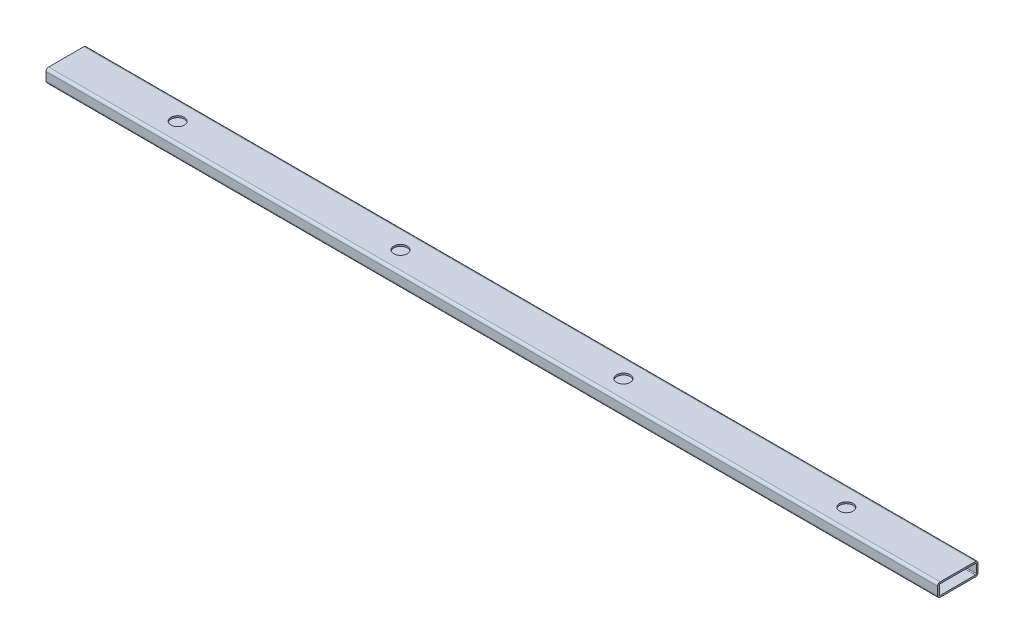
ISO-10303-21;
HEADER;
FILE_DESCRIPTION(('STEP AP214'),'2;1');
FILE_NAME('part.step','',(''),(''),'','','');
FILE_SCHEMA(('AUTOMOTIVE_DESIGN { 1 0 10303 214 1 1 1 1 }'));
ENDSEC;
DATA;
#1=APPLICATION_CONTEXT('core data for automotive mechanical design processes');
#2=APPLICATION_PROTOCOL_DEFINITION('international standard','automotive_design',2000,#1);
#3=PRODUCT_CONTEXT('',#1,'mechanical');
#4=PRODUCT('Part','Part','',(#3));
#5=PRODUCT_RELATED_PRODUCT_CATEGORY('part','',(#4));
#6=PRODUCT_DEFINITION_FORMATION('','',#4);
#7=PRODUCT_DEFINITION_CONTEXT('part definition',#1,'design');
#8=PRODUCT_DEFINITION('design','',#6,#7);
#9=PRODUCT_DEFINITION_SHAPE('','',#8);
#10=(LENGTH_UNIT() NAMED_UNIT(*) SI_UNIT(.MILLI.,.METRE.));
#11=(NAMED_UNIT(*) PLANE_ANGLE_UNIT() SI_UNIT($,.RADIAN.));
#12=(NAMED_UNIT(*) SI_UNIT($,.STERADIAN.) SOLID_ANGLE_UNIT());
#13=UNCERTAINTY_MEASURE_WITH_UNIT(LENGTH_MEASURE(1.E-05),#10,'distance_accuracy_value','');
#14=(GEOMETRIC_REPRESENTATION_CONTEXT(3) GLOBAL_UNCERTAINTY_ASSIGNED_CONTEXT((#13)) GLOBAL_UNIT_ASSIGNED_CONTEXT((#10,
#11,#12)) REPRESENTATION_CONTEXT('',''));
#15=CARTESIAN_POINT('',(0.,0.,0.));
#16=DIRECTION('',(0.,0.,1.));
#17=DIRECTION('',(1.,0.,0.));
#18=AXIS2_PLACEMENT_3D('',#15,#16,#17);
#19=CARTESIAN_POINT('',(631.03125,-0.00100000000002529,0.));
#20=DIRECTION('',(0.,1.,0.));
#21=DIRECTION('',(0.,0.,1.));
#22=AXIS2_PLACEMENT_3D('',#19,#20,#21);
#23=CYLINDRICAL_SURFACE('',#22,12.7);
#24=CARTESIAN_POINT('',(631.03125,22.225,0.));
#25=DIRECTION('',(0.,-1.,0.));
#26=DIRECTION('',(0.,0.,-1.));
#27=AXIS2_PLACEMENT_3D('',#24,#25,#26);
#28=CIRCLE('',#27,12.7);
#29=CARTESIAN_POINT('',(631.03125,22.225,-12.7));
#30=VERTEX_POINT('',#29);
#31=EDGE_CURVE('E43',#30,#30,#28,.F.);
#32=ORIENTED_EDGE('',*,*,#31,.F.);
#33=EDGE_LOOP('',(#32));
#34=FACE_BOUND('',#33,.T.);
#35=CARTESIAN_POINT('',(631.03125,25.4,0.));
#36=DIRECTION('',(0.,1.,0.));
#37=DIRECTION('',(0.,0.,1.));
#38=AXIS2_PLACEMENT_3D('',#35,#36,#37);
#39=CIRCLE('',#38,12.7);
#40=CARTESIAN_POINT('',(631.03125,25.4,12.7));
#41=VERTEX_POINT('',#40);
#42=EDGE_CURVE('E11',#41,#41,#39,.T.);
#43=ORIENTED_EDGE('',*,*,#42,.T.);
#44=EDGE_LOOP('',(#43));
#45=FACE_BOUND('',#44,.T.);
#46=ADVANCED_FACE('F36',(#34,#45),#23,.F.);
#47=CARTESIAN_POINT('',(210.34375,-0.00100000000002529,0.));
#48=DIRECTION('',(0.,1.,0.));
#49=DIRECTION('',(0.,0.,1.));
#50=AXIS2_PLACEMENT_3D('',#47,#48,#49);
#51=CYLINDRICAL_SURFACE('',#50,12.7);
#52=CARTESIAN_POINT('',(210.34375,22.225,0.));
#53=DIRECTION('',(0.,-1.,0.));
#54=DIRECTION('',(0.,0.,-1.));
#55=AXIS2_PLACEMENT_3D('',#52,#53,#54);
#56=CIRCLE('',#55,12.7);
#57=CARTESIAN_POINT('',(210.34375,22.225,-12.7));
#58=VERTEX_POINT('',#57);
#59=EDGE_CURVE('E274',#58,#58,#56,.F.);
#60=ORIENTED_EDGE('',*,*,#59,.F.);
#61=EDGE_LOOP('',(#60));
#62=FACE_BOUND('',#61,.T.);
#63=CARTESIAN_POINT('',(210.34375,25.4,0.));
#64=DIRECTION('',(0.,1.,0.));
#65=DIRECTION('',(0.,0.,1.));
#66=AXIS2_PLACEMENT_3D('',#63,#64,#65);
#67=CIRCLE('',#66,12.7);
#68=CARTESIAN_POINT('',(210.34375,25.4,12.7));
#69=VERTEX_POINT('',#68);
#70=EDGE_CURVE('E277',#69,#69,#67,.T.);
#71=ORIENTED_EDGE('',*,*,#70,.T.);
#72=EDGE_LOOP('',(#71));
#73=FACE_BOUND('',#72,.T.);
#74=ADVANCED_FACE('F285',(#62,#73),#51,.F.);
#75=CARTESIAN_POINT('',(841.375,20.6248,-33.3248));
#76=DIRECTION('',(1.,0.,0.));
#77=DIRECTION('',(0.,0.,-1.));
#78=AXIS2_PLACEMENT_3D('',#75,#76,#77);
#79=PLANE('',#78);
#80=CARTESIAN_POINT('',(841.375,20.6248,-33.3248));
#81=DIRECTION('',(1.,0.,0.));
#82=DIRECTION('',(0.,0.,-1.));
#83=AXIS2_PLACEMENT_3D('',#80,#81,#82);
#84=CIRCLE('',#83,4.77519999999999);
#85=CARTESIAN_POINT('',(841.375,20.6248,-38.1));
#86=VERTEX_POINT('',#85);
#87=CARTESIAN_POINT('',(841.375,25.4,-33.3248));
#88=VERTEX_POINT('',#87);
#89=EDGE_CURVE('E217',#86,#88,#84,.T.);
#90=ORIENTED_EDGE('',*,*,#89,.T.);
#91=DIRECTION('',(0.,0.,1.));
#92=VECTOR('',#91,1.);
#93=CARTESIAN_POINT('',(841.375,25.4,-33.3248));
#94=LINE('',#93,#92);
#95=CARTESIAN_POINT('',(841.375,25.4,33.3248));
#96=VERTEX_POINT('',#95);
#97=EDGE_CURVE('E220',#88,#96,#94,.T.);
#98=ORIENTED_EDGE('',*,*,#97,.T.);
#99=CARTESIAN_POINT('',(841.375,20.6248,33.3248));
#100=DIRECTION('',(1.,0.,0.));
#101=DIRECTION('',(0.,0.,1.));
#102=AXIS2_PLACEMENT_3D('',#99,#100,#101);
#103=CIRCLE('',#102,4.77519999999999);
#104=CARTESIAN_POINT('',(841.375,20.6248,38.1));
#105=VERTEX_POINT('',#104);
#106=EDGE_CURVE('E223',#96,#105,#103,.T.);
#107=ORIENTED_EDGE('',*,*,#106,.T.);
#108=DIRECTION('',(0.,-1.,0.));
#109=VECTOR('',#108,1.);
#110=CARTESIAN_POINT('',(841.375,20.6248,38.1));
#111=LINE('',#110,#109);
#112=CARTESIAN_POINT('',(841.375,4.77519999999999,38.1));
#113=VERTEX_POINT('',#112);
#114=EDGE_CURVE('E225',#105,#113,#111,.T.);
#115=ORIENTED_EDGE('',*,*,#114,.T.);
#116=CARTESIAN_POINT('',(841.375,4.77519999999999,33.3248));
#117=DIRECTION('',(1.,0.,0.));
#118=DIRECTION('',(0.,0.,1.));
#119=AXIS2_PLACEMENT_3D('',#116,#117,#118);
#120=CIRCLE('',#119,4.7752);
#121=CARTESIAN_POINT('',(841.375,0.,33.3248));
#122=VERTEX_POINT('',#121);
#123=EDGE_CURVE('E227',#113,#122,#120,.T.);
#124=ORIENTED_EDGE('',*,*,#123,.T.);
#125=DIRECTION('',(0.,0.,-1.));
#126=VECTOR('',#125,1.);
#127=CARTESIAN_POINT('',(841.375,0.,-33.3248));
#128=LINE('',#127,#126);
#129=CARTESIAN_POINT('',(841.375,0.,-33.3248));
#130=VERTEX_POINT('',#129);
#131=EDGE_CURVE('E229',#122,#130,#128,.T.);
#132=ORIENTED_EDGE('',*,*,#131,.T.);
#133=CARTESIAN_POINT('',(841.375,4.77520000000001,-33.3248));
#134=DIRECTION('',(1.,0.,0.));
#135=DIRECTION('',(0.,0.,1.));
#136=AXIS2_PLACEMENT_3D('',#133,#134,#135);
#137=CIRCLE('',#136,4.7752);
#138=CARTESIAN_POINT('',(841.375,4.77520000000001,-38.1));
#139=VERTEX_POINT('',#138);
#140=EDGE_CURVE('E231',#130,#139,#137,.T.);
#141=ORIENTED_EDGE('',*,*,#140,.T.);
#142=DIRECTION('',(0.,1.,0.));
#143=VECTOR('',#142,1.);
#144=CARTESIAN_POINT('',(841.375,20.6248,-38.1));
#145=LINE('',#144,#143);
#146=EDGE_CURVE('E233',#139,#86,#145,.T.);
#147=ORIENTED_EDGE('',*,*,#146,.T.);
#148=EDGE_LOOP('',(#90,#98,#107,#115,#124,#132,#141,#147));
#149=FACE_BOUND('',#148,.T.);
#150=DIRECTION('',(0.,0.,1.));
#151=VECTOR('',#150,1.);
#152=CARTESIAN_POINT('',(841.375,22.225,-33.3248));
#153=LINE('',#152,#151);
#154=CARTESIAN_POINT('',(841.375,22.225,-33.3248));
#155=VERTEX_POINT('',#154);
#156=CARTESIAN_POINT('',(841.375,22.225,33.3248));
#157=VERTEX_POINT('',#156);
#158=EDGE_CURVE('E156',#155,#157,#153,.T.);
#159=ORIENTED_EDGE('',*,*,#158,.F.);
#160=CARTESIAN_POINT('',(841.375,20.6248,-33.3248));
#161=DIRECTION('',(1.,0.,0.));
#162=DIRECTION('',(0.,0.,-1.));
#163=AXIS2_PLACEMENT_3D('',#160,#161,#162);
#164=CIRCLE('',#163,1.6002);
#165=CARTESIAN_POINT('',(841.375,20.6248,-34.925));
#166=VERTEX_POINT('',#165);
#167=EDGE_CURVE('E148',#166,#155,#164,.T.);
#168=ORIENTED_EDGE('',*,*,#167,.F.);
#169=DIRECTION('',(0.,1.,0.));
#170=VECTOR('',#169,1.);
#171=CARTESIAN_POINT('',(841.375,20.6248,-34.925));
#172=LINE('',#171,#170);
#173=CARTESIAN_POINT('',(841.375,4.77520000000001,-34.925));
#174=VERTEX_POINT('',#173);
#175=EDGE_CURVE('E184',#174,#166,#172,.T.);
#176=ORIENTED_EDGE('',*,*,#175,.F.);
#177=CARTESIAN_POINT('',(841.375,4.77520000000001,-33.3248));
#178=DIRECTION('',(1.,0.,0.));
#179=DIRECTION('',(0.,0.,1.));
#180=AXIS2_PLACEMENT_3D('',#177,#178,#179);
#181=CIRCLE('',#180,1.6002);
#182=CARTESIAN_POINT('',(841.375,3.17500000000001,-33.3248));
#183=VERTEX_POINT('',#182);
#184=EDGE_CURVE('E182',#183,#174,#181,.T.);
#185=ORIENTED_EDGE('',*,*,#184,.F.);
#186=DIRECTION('',(0.,0.,-1.));
#187=VECTOR('',#186,1.);
#188=CARTESIAN_POINT('',(841.375,3.17500000000001,-33.3248));
#189=LINE('',#188,#187);
#190=CARTESIAN_POINT('',(841.375,3.17499999999999,33.3248));
#191=VERTEX_POINT('',#190);
#192=EDGE_CURVE('E180',#191,#183,#189,.T.);
#193=ORIENTED_EDGE('',*,*,#192,.F.);
#194=CARTESIAN_POINT('',(841.375,4.77519999999999,33.3248));
#195=DIRECTION('',(1.,0.,0.));
#196=DIRECTION('',(0.,0.,1.));
#197=AXIS2_PLACEMENT_3D('',#194,#195,#196);
#198=CIRCLE('',#197,1.60020000000001);
#199=CARTESIAN_POINT('',(841.375,4.77519999999999,34.925));
#200=VERTEX_POINT('',#199);
#201=EDGE_CURVE('E178',#200,#191,#198,.T.);
#202=ORIENTED_EDGE('',*,*,#201,.F.);
#203=DIRECTION('',(0.,-1.,0.));
#204=VECTOR('',#203,1.);
#205=CARTESIAN_POINT('',(841.375,20.6248,34.925));
#206=LINE('',#205,#204);
#207=CARTESIAN_POINT('',(841.375,20.6248,34.925));
#208=VERTEX_POINT('',#207);
#209=EDGE_CURVE('E173',#208,#200,#206,.T.);
#210=ORIENTED_EDGE('',*,*,#209,.F.);
#211=CARTESIAN_POINT('',(841.375,20.6248,33.3248));
#212=DIRECTION('',(1.,0.,0.));
#213=DIRECTION('',(0.,0.,1.));
#214=AXIS2_PLACEMENT_3D('',#211,#212,#213);
#215=CIRCLE('',#214,1.60020000000001);
#216=EDGE_CURVE('E171',#157,#208,#215,.T.);
#217=ORIENTED_EDGE('',*,*,#216,.F.);
#218=EDGE_LOOP('',(#159,#168,#176,#185,#193,#202,#210,#217));
#219=FACE_BOUND('',#218,.T.);
#220=ADVANCED_FACE('F169',(#149,#219),#79,.T.);
#221=CARTESIAN_POINT('',(-841.375,20.6248,-33.3248));
#222=DIRECTION('',(1.,0.,0.));
#223=DIRECTION('',(0.,0.,-1.));
#224=AXIS2_PLACEMENT_3D('',#221,#222,#223);
#225=PLANE('',#224);
#226=CARTESIAN_POINT('',(-841.375,20.6248,-33.3248));
#227=DIRECTION('',(1.,0.,0.));
#228=DIRECTION('',(0.,0.,-1.));
#229=AXIS2_PLACEMENT_3D('',#226,#227,#228);
#230=CIRCLE('',#229,4.77519999999999);
#231=CARTESIAN_POINT('',(-841.375,20.6248,-38.1));
#232=VERTEX_POINT('',#231);
#233=CARTESIAN_POINT('',(-841.375,25.4,-33.3248));
#234=VERTEX_POINT('',#233);
#235=EDGE_CURVE('E165',#232,#234,#230,.T.);
#236=ORIENTED_EDGE('',*,*,#235,.F.);
#237=DIRECTION('',(0.,1.,0.));
#238=VECTOR('',#237,1.);
#239=CARTESIAN_POINT('',(-841.375,20.6248,-38.1));
#240=LINE('',#239,#238);
#241=CARTESIAN_POINT('',(-841.375,4.77520000000001,-38.1));
#242=VERTEX_POINT('',#241);
#243=EDGE_CURVE('E221',#242,#232,#240,.T.);
#244=ORIENTED_EDGE('',*,*,#243,.F.);
#245=CARTESIAN_POINT('',(-841.375,4.77520000000001,-33.3248));
#246=DIRECTION('',(1.,0.,0.));
#247=DIRECTION('',(0.,0.,1.));
#248=AXIS2_PLACEMENT_3D('',#245,#246,#247);
#249=CIRCLE('',#248,4.7752);
#250=CARTESIAN_POINT('',(-841.375,0.,-33.3248));
#251=VERTEX_POINT('',#250);
#252=EDGE_CURVE('E248',#251,#242,#249,.T.);
#253=ORIENTED_EDGE('',*,*,#252,.F.);
#254=DIRECTION('',(0.,0.,-1.));
#255=VECTOR('',#254,1.);
#256=CARTESIAN_POINT('',(-841.375,0.,-33.3248));
#257=LINE('',#256,#255);
#258=CARTESIAN_POINT('',(-841.375,0.,33.3248));
#259=VERTEX_POINT('',#258);
#260=EDGE_CURVE('E246',#259,#251,#257,.T.);
#261=ORIENTED_EDGE('',*,*,#260,.F.);
#262=CARTESIAN_POINT('',(-841.375,4.77519999999999,33.3248));
#263=DIRECTION('',(1.,0.,0.));
#264=DIRECTION('',(0.,0.,1.));
#265=AXIS2_PLACEMENT_3D('',#262,#263,#264);
#266=CIRCLE('',#265,4.7752);
#267=CARTESIAN_POINT('',(-841.375,4.77519999999999,38.1));
#268=VERTEX_POINT('',#267);
#269=EDGE_CURVE('E244',#268,#259,#266,.T.);
#270=ORIENTED_EDGE('',*,*,#269,.F.);
#271=DIRECTION('',(0.,-1.,0.));
#272=VECTOR('',#271,1.);
#273=CARTESIAN_POINT('',(-841.375,20.6248,38.1));
#274=LINE('',#273,#272);
#275=CARTESIAN_POINT('',(-841.375,20.6248,38.1));
#276=VERTEX_POINT('',#275);
#277=EDGE_CURVE('E242',#276,#268,#274,.T.);
#278=ORIENTED_EDGE('',*,*,#277,.F.);
#279=CARTESIAN_POINT('',(-841.375,20.6248,33.3248));
#280=DIRECTION('',(1.,0.,0.));
#281=DIRECTION('',(0.,0.,1.));
#282=AXIS2_PLACEMENT_3D('',#279,#280,#281);
#283=CIRCLE('',#282,4.77519999999999);
#284=CARTESIAN_POINT('',(-841.375,25.4,33.3248));
#285=VERTEX_POINT('',#284);
#286=EDGE_CURVE('E240',#285,#276,#283,.T.);
#287=ORIENTED_EDGE('',*,*,#286,.F.);
#288=DIRECTION('',(0.,0.,1.));
#289=VECTOR('',#288,1.);
#290=CARTESIAN_POINT('',(-841.375,25.4,-33.3248));
#291=LINE('',#290,#289);
#292=EDGE_CURVE('E238',#234,#285,#291,.T.);
#293=ORIENTED_EDGE('',*,*,#292,.F.);
#294=EDGE_LOOP('',(#236,#244,#253,#261,#270,#278,#287,#293));
#295=FACE_BOUND('',#294,.T.);
#296=CARTESIAN_POINT('',(-841.375,20.6248,-33.3248));
#297=DIRECTION('',(1.,0.,0.));
#298=DIRECTION('',(0.,0.,-1.));
#299=AXIS2_PLACEMENT_3D('',#296,#297,#298);
#300=CIRCLE('',#299,1.6002);
#301=CARTESIAN_POINT('',(-841.375,20.6248,-34.925));
#302=VERTEX_POINT('',#301);
#303=CARTESIAN_POINT('',(-841.375,22.225,-33.3248));
#304=VERTEX_POINT('',#303);
#305=EDGE_CURVE('E58',#302,#304,#300,.T.);
#306=ORIENTED_EDGE('',*,*,#305,.T.);
#307=DIRECTION('',(0.,0.,1.));
#308=VECTOR('',#307,1.);
#309=CARTESIAN_POINT('',(-841.375,22.225,-33.3248));
#310=LINE('',#309,#308);
#311=CARTESIAN_POINT('',(-841.375,22.225,33.3248));
#312=VERTEX_POINT('',#311);
#313=EDGE_CURVE('E164',#304,#312,#310,.T.);
#314=ORIENTED_EDGE('',*,*,#313,.T.);
#315=CARTESIAN_POINT('',(-841.375,20.6248,33.3248));
#316=DIRECTION('',(1.,0.,0.));
#317=DIRECTION('',(0.,0.,1.));
#318=AXIS2_PLACEMENT_3D('',#315,#316,#317);
#319=CIRCLE('',#318,1.60020000000001);
#320=CARTESIAN_POINT('',(-841.375,20.6248,34.925));
#321=VERTEX_POINT('',#320);
#322=EDGE_CURVE('E189',#312,#321,#319,.T.);
#323=ORIENTED_EDGE('',*,*,#322,.T.);
#324=DIRECTION('',(0.,-1.,0.));
#325=VECTOR('',#324,1.);
#326=CARTESIAN_POINT('',(-841.375,20.6248,34.925));
#327=LINE('',#326,#325);
#328=CARTESIAN_POINT('',(-841.375,4.77519999999999,34.925));
#329=VERTEX_POINT('',#328);
#330=EDGE_CURVE('E192',#321,#329,#327,.T.);
#331=ORIENTED_EDGE('',*,*,#330,.T.);
#332=CARTESIAN_POINT('',(-841.375,4.77519999999999,33.3248));
#333=DIRECTION('',(1.,0.,0.));
#334=DIRECTION('',(0.,0.,1.));
#335=AXIS2_PLACEMENT_3D('',#332,#333,#334);
#336=CIRCLE('',#335,1.60020000000001);
#337=CARTESIAN_POINT('',(-841.375,3.17499999999999,33.3248));
#338=VERTEX_POINT('',#337);
#339=EDGE_CURVE('E195',#329,#338,#336,.T.);
#340=ORIENTED_EDGE('',*,*,#339,.T.);
#341=DIRECTION('',(0.,0.,-1.));
#342=VECTOR('',#341,1.);
#343=CARTESIAN_POINT('',(-841.375,3.17500000000001,-33.3248));
#344=LINE('',#343,#342);
#345=CARTESIAN_POINT('',(-841.375,3.17500000000001,-33.3248));
#346=VERTEX_POINT('',#345);
#347=EDGE_CURVE('E198',#338,#346,#344,.T.);
#348=ORIENTED_EDGE('',*,*,#347,.T.);
#349=CARTESIAN_POINT('',(-841.375,4.77520000000001,-33.3248));
#350=DIRECTION('',(1.,0.,0.));
#351=DIRECTION('',(0.,0.,1.));
#352=AXIS2_PLACEMENT_3D('',#349,#350,#351);
#353=CIRCLE('',#352,1.6002);
#354=CARTESIAN_POINT('',(-841.375,4.77520000000001,-34.925));
#355=VERTEX_POINT('',#354);
#356=EDGE_CURVE('E201',#346,#355,#353,.T.);
#357=ORIENTED_EDGE('',*,*,#356,.T.);
#358=DIRECTION('',(0.,1.,0.));
#359=VECTOR('',#358,1.);
#360=CARTESIAN_POINT('',(-841.375,20.6248,-34.925));
#361=LINE('',#360,#359);
#362=EDGE_CURVE('E157',#355,#302,#361,.T.);
#363=ORIENTED_EDGE('',*,*,#362,.T.);
#364=EDGE_LOOP('',(#306,#314,#323,#331,#340,#348,#357,#363));
#365=FACE_BOUND('',#364,.T.);
#366=ADVANCED_FACE('F301',(#295,#365),#225,.F.);
#367=CARTESIAN_POINT('',(841.375,20.6248,-33.3248));
#368=DIRECTION('',(-1.,0.,0.));
#369=DIRECTION('',(0.,0.,1.));
#370=AXIS2_PLACEMENT_3D('',#367,#368,#369);
#371=CYLINDRICAL_SURFACE('',#370,4.77519999999999);
#372=ORIENTED_EDGE('',*,*,#235,.T.);
#373=DIRECTION('',(-1.,0.,0.));
#374=VECTOR('',#373,1.);
#375=CARTESIAN_POINT('',(841.375,25.4,-33.3248));
#376=LINE('',#375,#374);
#377=EDGE_CURVE('E271',#88,#234,#376,.T.);
#378=ORIENTED_EDGE('',*,*,#377,.F.);
#379=ORIENTED_EDGE('',*,*,#89,.F.);
#380=DIRECTION('',(-1.,0.,0.));
#381=VECTOR('',#380,1.);
#382=CARTESIAN_POINT('',(841.375,20.6248,-38.1));
#383=LINE('',#382,#381);
#384=EDGE_CURVE('E235',#86,#232,#383,.T.);
#385=ORIENTED_EDGE('',*,*,#384,.T.);
#386=EDGE_LOOP('',(#372,#378,#379,#385));
#387=FACE_BOUND('',#386,.T.);
#388=ADVANCED_FACE('F291',(#387),#371,.T.);
#389=CARTESIAN_POINT('',(841.375,25.4,-33.3248));
#390=DIRECTION('',(0.,-1.,0.));
#391=DIRECTION('',(0.,0.,-1.));
#392=AXIS2_PLACEMENT_3D('',#389,#390,#391);
#393=PLANE('',#392);
#394=CARTESIAN_POINT('',(-210.34375,25.4,0.));
#395=DIRECTION('',(0.,1.,0.));
#396=DIRECTION('',(0.,0.,1.));
#397=AXIS2_PLACEMENT_3D('',#394,#395,#396);
#398=CIRCLE('',#397,12.7);
#399=CARTESIAN_POINT('',(-210.34375,25.4,12.7));
#400=VERTEX_POINT('',#399);
#401=EDGE_CURVE('E425',#400,#400,#398,.T.);
#402=ORIENTED_EDGE('',*,*,#401,.F.);
#403=EDGE_LOOP('',(#402));
#404=FACE_BOUND('',#403,.T.);
#405=CARTESIAN_POINT('',(-631.03125,25.4,0.));
#406=DIRECTION('',(0.,1.,0.));
#407=DIRECTION('',(0.,0.,1.));
#408=AXIS2_PLACEMENT_3D('',#405,#406,#407);
#409=CIRCLE('',#408,12.7);
#410=CARTESIAN_POINT('',(-631.03125,25.4,12.7));
#411=VERTEX_POINT('',#410);
#412=EDGE_CURVE('E187',#411,#411,#409,.T.);
#413=ORIENTED_EDGE('',*,*,#412,.F.);
#414=EDGE_LOOP('',(#413));
#415=FACE_BOUND('',#414,.T.);
#416=ORIENTED_EDGE('',*,*,#292,.T.);
#417=DIRECTION('',(-1.,0.,0.));
#418=VECTOR('',#417,1.);
#419=CARTESIAN_POINT('',(841.375,25.4,33.3248));
#420=LINE('',#419,#418);
#421=EDGE_CURVE('E268',#96,#285,#420,.T.);
#422=ORIENTED_EDGE('',*,*,#421,.F.);
#423=ORIENTED_EDGE('',*,*,#97,.F.);
#424=ORIENTED_EDGE('',*,*,#377,.T.);
#425=EDGE_LOOP('',(#416,#422,#423,#424));
#426=FACE_BOUND('',#425,.T.);
#427=ORIENTED_EDGE('',*,*,#70,.F.);
#428=EDGE_LOOP('',(#427));
#429=FACE_BOUND('',#428,.T.);
#430=ORIENTED_EDGE('',*,*,#42,.F.);
#431=EDGE_LOOP('',(#430));
#432=FACE_BOUND('',#431,.T.);
#433=ADVANCED_FACE('F288',(#404,#415,#426,#429,#432),#393,.F.);
#434=CARTESIAN_POINT('',(841.375,20.6248,33.3248));
#435=DIRECTION('',(-1.,0.,0.));
#436=DIRECTION('',(0.,0.,1.));
#437=AXIS2_PLACEMENT_3D('',#434,#435,#436);
#438=CYLINDRICAL_SURFACE('',#437,4.77519999999999);
#439=ORIENTED_EDGE('',*,*,#286,.T.);
#440=DIRECTION('',(-1.,0.,0.));
#441=VECTOR('',#440,1.);
#442=CARTESIAN_POINT('',(841.375,20.6248,38.1));
#443=LINE('',#442,#441);
#444=EDGE_CURVE('E265',#105,#276,#443,.T.);
#445=ORIENTED_EDGE('',*,*,#444,.F.);
#446=ORIENTED_EDGE('',*,*,#106,.F.);
#447=ORIENTED_EDGE('',*,*,#421,.T.);
#448=EDGE_LOOP('',(#439,#445,#446,#447));
#449=FACE_BOUND('',#448,.T.);
#450=ADVANCED_FACE('F290',(#449),#438,.T.);
#451=CARTESIAN_POINT('',(841.375,20.6248,38.1));
#452=DIRECTION('',(0.,0.,-1.));
#453=DIRECTION('',(0.,1.,0.));
#454=AXIS2_PLACEMENT_3D('',#451,#452,#453);
#455=PLANE('',#454);
#456=ORIENTED_EDGE('',*,*,#277,.T.);
#457=DIRECTION('',(-1.,0.,0.));
#458=VECTOR('',#457,1.);
#459=CARTESIAN_POINT('',(841.375,4.77519999999999,38.1));
#460=LINE('',#459,#458);
#461=EDGE_CURVE('E262',#113,#268,#460,.T.);
#462=ORIENTED_EDGE('',*,*,#461,.F.);
#463=ORIENTED_EDGE('',*,*,#114,.F.);
#464=ORIENTED_EDGE('',*,*,#444,.T.);
#465=EDGE_LOOP('',(#456,#462,#463,#464));
#466=FACE_BOUND('',#465,.T.);
#467=ADVANCED_FACE('F298',(#466),#455,.F.);
#468=CARTESIAN_POINT('',(841.375,4.77519999999999,33.3248));
#469=DIRECTION('',(-1.,0.,0.));
#470=DIRECTION('',(0.,0.,1.));
#471=AXIS2_PLACEMENT_3D('',#468,#469,#470);
#472=CYLINDRICAL_SURFACE('',#471,4.7752);
#473=ORIENTED_EDGE('',*,*,#269,.T.);
#474=DIRECTION('',(-1.,0.,0.));
#475=VECTOR('',#474,1.);
#476=CARTESIAN_POINT('',(841.375,0.,33.3248));
#477=LINE('',#476,#475);
#478=EDGE_CURVE('E259',#122,#259,#477,.T.);
#479=ORIENTED_EDGE('',*,*,#478,.F.);
#480=ORIENTED_EDGE('',*,*,#123,.F.);
#481=ORIENTED_EDGE('',*,*,#461,.T.);
#482=EDGE_LOOP('',(#473,#479,#480,#481));
#483=FACE_BOUND('',#482,.T.);
#484=ADVANCED_FACE('F348',(#483),#472,.T.);
#485=CARTESIAN_POINT('',(841.375,0.,-33.3248));
#486=DIRECTION('',(0.,1.,0.));
#487=DIRECTION('',(0.,0.,1.));
#488=AXIS2_PLACEMENT_3D('',#485,#486,#487);
#489=PLANE('',#488);
#490=ORIENTED_EDGE('',*,*,#260,.T.);
#491=DIRECTION('',(-1.,0.,0.));
#492=VECTOR('',#491,1.);
#493=CARTESIAN_POINT('',(841.375,0.,-33.3248));
#494=LINE('',#493,#492);
#495=EDGE_CURVE('E256',#130,#251,#494,.T.);
#496=ORIENTED_EDGE('',*,*,#495,.F.);
#497=ORIENTED_EDGE('',*,*,#131,.F.);
#498=ORIENTED_EDGE('',*,*,#478,.T.);
#499=EDGE_LOOP('',(#490,#496,#497,#498));
#500=FACE_BOUND('',#499,.T.);
#501=ADVANCED_FACE('F344',(#500),#489,.F.);
#502=CARTESIAN_POINT('',(841.375,4.77520000000001,-33.3248));
#503=DIRECTION('',(-1.,0.,0.));
#504=DIRECTION('',(0.,0.,1.));
#505=AXIS2_PLACEMENT_3D('',#502,#503,#504);
#506=CYLINDRICAL_SURFACE('',#505,4.7752);
#507=ORIENTED_EDGE('',*,*,#252,.T.);
#508=DIRECTION('',(-1.,0.,0.));
#509=VECTOR('',#508,1.);
#510=CARTESIAN_POINT('',(841.375,4.77520000000001,-38.1));
#511=LINE('',#510,#509);
#512=EDGE_CURVE('E253',#139,#242,#511,.T.);
#513=ORIENTED_EDGE('',*,*,#512,.F.);
#514=ORIENTED_EDGE('',*,*,#140,.F.);
#515=ORIENTED_EDGE('',*,*,#495,.T.);
#516=EDGE_LOOP('',(#507,#513,#514,#515));
#517=FACE_BOUND('',#516,.T.);
#518=ADVANCED_FACE('F340',(#517),#506,.T.);
#519=CARTESIAN_POINT('',(841.375,20.6248,-38.1));
#520=DIRECTION('',(0.,0.,1.));
#521=DIRECTION('',(0.,-1.,0.));
#522=AXIS2_PLACEMENT_3D('',#519,#520,#521);
#523=PLANE('',#522);
#524=ORIENTED_EDGE('',*,*,#243,.T.);
#525=ORIENTED_EDGE('',*,*,#384,.F.);
#526=ORIENTED_EDGE('',*,*,#146,.F.);
#527=ORIENTED_EDGE('',*,*,#512,.T.);
#528=EDGE_LOOP('',(#524,#525,#526,#527));
#529=FACE_BOUND('',#528,.T.);
#530=ADVANCED_FACE('F329',(#529),#523,.F.);
#531=CARTESIAN_POINT('',(841.375,20.6248,-33.3248));
#532=DIRECTION('',(-1.,0.,0.));
#533=DIRECTION('',(0.,0.,1.));
#534=AXIS2_PLACEMENT_3D('',#531,#532,#533);
#535=CYLINDRICAL_SURFACE('',#534,1.6002);
#536=ORIENTED_EDGE('',*,*,#305,.F.);
#537=DIRECTION('',(-1.,0.,0.));
#538=VECTOR('',#537,1.);
#539=CARTESIAN_POINT('',(841.375,20.6248,-34.925));
#540=LINE('',#539,#538);
#541=EDGE_CURVE('E152',#166,#302,#540,.T.);
#542=ORIENTED_EDGE('',*,*,#541,.F.);
#543=ORIENTED_EDGE('',*,*,#167,.T.);
#544=DIRECTION('',(-1.,0.,0.));
#545=VECTOR('',#544,1.);
#546=CARTESIAN_POINT('',(841.375,22.225,-33.3248));
#547=LINE('',#546,#545);
#548=EDGE_CURVE('E151',#155,#304,#547,.T.);
#549=ORIENTED_EDGE('',*,*,#548,.T.);
#550=EDGE_LOOP('',(#536,#542,#543,#549));
#551=FACE_BOUND('',#550,.T.);
#552=ADVANCED_FACE('F150',(#551),#535,.F.);
#553=CARTESIAN_POINT('',(841.375,22.225,-33.3248));
#554=DIRECTION('',(0.,-1.,0.));
#555=DIRECTION('',(0.,0.,-1.));
#556=AXIS2_PLACEMENT_3D('',#553,#554,#555);
#557=PLANE('',#556);
#558=CARTESIAN_POINT('',(-210.34375,22.225,0.));
#559=DIRECTION('',(0.,-1.,0.));
#560=DIRECTION('',(0.,0.,-1.));
#561=AXIS2_PLACEMENT_3D('',#558,#559,#560);
#562=CIRCLE('',#561,12.7);
#563=CARTESIAN_POINT('',(-210.34375,22.225,-12.7));
#564=VERTEX_POINT('',#563);
#565=EDGE_CURVE('E423',#564,#564,#562,.F.);
#566=ORIENTED_EDGE('',*,*,#565,.T.);
#567=EDGE_LOOP('',(#566));
#568=FACE_BOUND('',#567,.T.);
#569=CARTESIAN_POINT('',(-631.03125,22.225,0.));
#570=DIRECTION('',(0.,-1.,0.));
#571=DIRECTION('',(0.,0.,-1.));
#572=AXIS2_PLACEMENT_3D('',#569,#570,#571);
#573=CIRCLE('',#572,12.7);
#574=CARTESIAN_POINT('',(-631.03125,22.225,-12.7));
#575=VERTEX_POINT('',#574);
#576=EDGE_CURVE('E426',#575,#575,#573,.F.);
#577=ORIENTED_EDGE('',*,*,#576,.T.);
#578=EDGE_LOOP('',(#577));
#579=FACE_BOUND('',#578,.T.);
#580=ORIENTED_EDGE('',*,*,#313,.F.);
#581=ORIENTED_EDGE('',*,*,#548,.F.);
#582=ORIENTED_EDGE('',*,*,#158,.T.);
#583=DIRECTION('',(-1.,0.,0.));
#584=VECTOR('',#583,1.);
#585=CARTESIAN_POINT('',(841.375,22.225,33.3248));
#586=LINE('',#585,#584);
#587=EDGE_CURVE('E166',#157,#312,#586,.T.);
#588=ORIENTED_EDGE('',*,*,#587,.T.);
#589=EDGE_LOOP('',(#580,#581,#582,#588));
#590=FACE_BOUND('',#589,.T.);
#591=ORIENTED_EDGE('',*,*,#59,.T.);
#592=EDGE_LOOP('',(#591));
#593=FACE_BOUND('',#592,.T.);
#594=ORIENTED_EDGE('',*,*,#31,.T.);
#595=EDGE_LOOP('',(#594));
#596=FACE_BOUND('',#595,.T.);
#597=ADVANCED_FACE('F160',(#568,#579,#590,#593,#596),#557,.T.);
#598=CARTESIAN_POINT('',(841.375,20.6248,33.3248));
#599=DIRECTION('',(-1.,0.,0.));
#600=DIRECTION('',(0.,0.,1.));
#601=AXIS2_PLACEMENT_3D('',#598,#599,#600);
#602=CYLINDRICAL_SURFACE('',#601,1.60020000000001);
#603=ORIENTED_EDGE('',*,*,#322,.F.);
#604=ORIENTED_EDGE('',*,*,#587,.F.);
#605=ORIENTED_EDGE('',*,*,#216,.T.);
#606=DIRECTION('',(-1.,0.,0.));
#607=VECTOR('',#606,1.);
#608=CARTESIAN_POINT('',(841.375,20.6248,34.925));
#609=LINE('',#608,#607);
#610=EDGE_CURVE('E214',#208,#321,#609,.T.);
#611=ORIENTED_EDGE('',*,*,#610,.T.);
#612=EDGE_LOOP('',(#603,#604,#605,#611));
#613=FACE_BOUND('',#612,.T.);
#614=ADVANCED_FACE('F319',(#613),#602,.F.);
#615=CARTESIAN_POINT('',(841.375,20.6248,34.925));
#616=DIRECTION('',(0.,0.,-1.));
#617=DIRECTION('',(-1.,0.,0.));
#618=AXIS2_PLACEMENT_3D('',#615,#616,#617);
#619=PLANE('',#618);
#620=ORIENTED_EDGE('',*,*,#330,.F.);
#621=ORIENTED_EDGE('',*,*,#610,.F.);
#622=ORIENTED_EDGE('',*,*,#209,.T.);
#623=DIRECTION('',(-1.,0.,0.));
#624=VECTOR('',#623,1.);
#625=CARTESIAN_POINT('',(841.375,4.77519999999999,34.925));
#626=LINE('',#625,#624);
#627=EDGE_CURVE('E212',#200,#329,#626,.T.);
#628=ORIENTED_EDGE('',*,*,#627,.T.);
#629=EDGE_LOOP('',(#620,#621,#622,#628));
#630=FACE_BOUND('',#629,.T.);
#631=ADVANCED_FACE('F326',(#630),#619,.T.);
#632=CARTESIAN_POINT('',(841.375,4.77519999999999,33.3248));
#633=DIRECTION('',(-1.,0.,0.));
#634=DIRECTION('',(0.,0.,1.));
#635=AXIS2_PLACEMENT_3D('',#632,#633,#634);
#636=CYLINDRICAL_SURFACE('',#635,1.60020000000001);
#637=ORIENTED_EDGE('',*,*,#339,.F.);
#638=ORIENTED_EDGE('',*,*,#627,.F.);
#639=ORIENTED_EDGE('',*,*,#201,.T.);
#640=DIRECTION('',(-1.,0.,0.));
#641=VECTOR('',#640,1.);
#642=CARTESIAN_POINT('',(841.375,3.17499999999999,33.3248));
#643=LINE('',#642,#641);
#644=EDGE_CURVE('E210',#191,#338,#643,.T.);
#645=ORIENTED_EDGE('',*,*,#644,.T.);
#646=EDGE_LOOP('',(#637,#638,#639,#645));
#647=FACE_BOUND('',#646,.T.);
#648=ADVANCED_FACE('F394',(#647),#636,.F.);
#649=CARTESIAN_POINT('',(841.375,3.17500000000001,-33.3248));
#650=DIRECTION('',(0.,1.,0.));
#651=DIRECTION('',(0.,0.,1.));
#652=AXIS2_PLACEMENT_3D('',#649,#650,#651);
#653=PLANE('',#652);
#654=ORIENTED_EDGE('',*,*,#347,.F.);
#655=ORIENTED_EDGE('',*,*,#644,.F.);
#656=ORIENTED_EDGE('',*,*,#192,.T.);
#657=DIRECTION('',(-1.,0.,0.));
#658=VECTOR('',#657,1.);
#659=CARTESIAN_POINT('',(841.375,3.17500000000001,-33.3248));
#660=LINE('',#659,#658);
#661=EDGE_CURVE('E208',#183,#346,#660,.T.);
#662=ORIENTED_EDGE('',*,*,#661,.T.);
#663=EDGE_LOOP('',(#654,#655,#656,#662));
#664=FACE_BOUND('',#663,.T.);
#665=ADVANCED_FACE('F390',(#664),#653,.T.);
#666=CARTESIAN_POINT('',(841.375,4.77520000000001,-33.3248));
#667=DIRECTION('',(-1.,0.,0.));
#668=DIRECTION('',(0.,0.,1.));
#669=AXIS2_PLACEMENT_3D('',#666,#667,#668);
#670=CYLINDRICAL_SURFACE('',#669,1.6002);
#671=ORIENTED_EDGE('',*,*,#356,.F.);
#672=ORIENTED_EDGE('',*,*,#661,.F.);
#673=ORIENTED_EDGE('',*,*,#184,.T.);
#674=DIRECTION('',(-1.,0.,0.));
#675=VECTOR('',#674,1.);
#676=CARTESIAN_POINT('',(841.375,4.77520000000001,-34.925));
#677=LINE('',#676,#675);
#678=EDGE_CURVE('E50',#174,#355,#677,.T.);
#679=ORIENTED_EDGE('',*,*,#678,.T.);
#680=EDGE_LOOP('',(#671,#672,#673,#679));
#681=FACE_BOUND('',#680,.T.);
#682=ADVANCED_FACE('F387',(#681),#670,.F.);
#683=CARTESIAN_POINT('',(841.375,20.6248,-34.925));
#684=DIRECTION('',(0.,0.,1.));
#685=DIRECTION('',(0.,-1.,0.));
#686=AXIS2_PLACEMENT_3D('',#683,#684,#685);
#687=PLANE('',#686);
#688=ORIENTED_EDGE('',*,*,#362,.F.);
#689=ORIENTED_EDGE('',*,*,#678,.F.);
#690=ORIENTED_EDGE('',*,*,#175,.T.);
#691=ORIENTED_EDGE('',*,*,#541,.T.);
#692=EDGE_LOOP('',(#688,#689,#690,#691));
#693=FACE_BOUND('',#692,.T.);
#694=ADVANCED_FACE('F381',(#693),#687,.T.);
#695=CARTESIAN_POINT('',(-631.03125,-0.00100000000002529,0.));
#696=DIRECTION('',(0.,1.,0.));
#697=DIRECTION('',(0.,0.,1.));
#698=AXIS2_PLACEMENT_3D('',#695,#696,#697);
#699=CYLINDRICAL_SURFACE('',#698,12.7);
#700=ORIENTED_EDGE('',*,*,#576,.F.);
#701=EDGE_LOOP('',(#700));
#702=FACE_BOUND('',#701,.T.);
#703=ORIENTED_EDGE('',*,*,#412,.T.);
#704=EDGE_LOOP('',(#703));
#705=FACE_BOUND('',#704,.T.);
#706=ADVANCED_FACE('F412',(#702,#705),#699,.F.);
#707=CARTESIAN_POINT('',(-210.34375,-0.00100000000002529,0.));
#708=DIRECTION('',(0.,1.,0.));
#709=DIRECTION('',(0.,0.,1.));
#710=AXIS2_PLACEMENT_3D('',#707,#708,#709);
#711=CYLINDRICAL_SURFACE('',#710,12.7);
#712=ORIENTED_EDGE('',*,*,#565,.F.);
#713=EDGE_LOOP('',(#712));
#714=FACE_BOUND('',#713,.T.);
#715=ORIENTED_EDGE('',*,*,#401,.T.);
#716=EDGE_LOOP('',(#715));
#717=FACE_BOUND('',#716,.T.);
#718=ADVANCED_FACE('F415',(#714,#717),#711,.F.);
#719=CLOSED_SHELL('',(#46,#74,#220,#366,#388,#433,#450,#467,#484,#501,#518,#530,#552,#597,#614,
#631,#648,#665,#682,#694,#706,#718));
#720=MANIFOLD_SOLID_BREP('B2',#719);
#721=ADVANCED_BREP_SHAPE_REPRESENTATION('',(#18,#720),#14);
#722=SHAPE_DEFINITION_REPRESENTATION(#9,#721);
ENDSEC;
END-ISO-10303-21;
